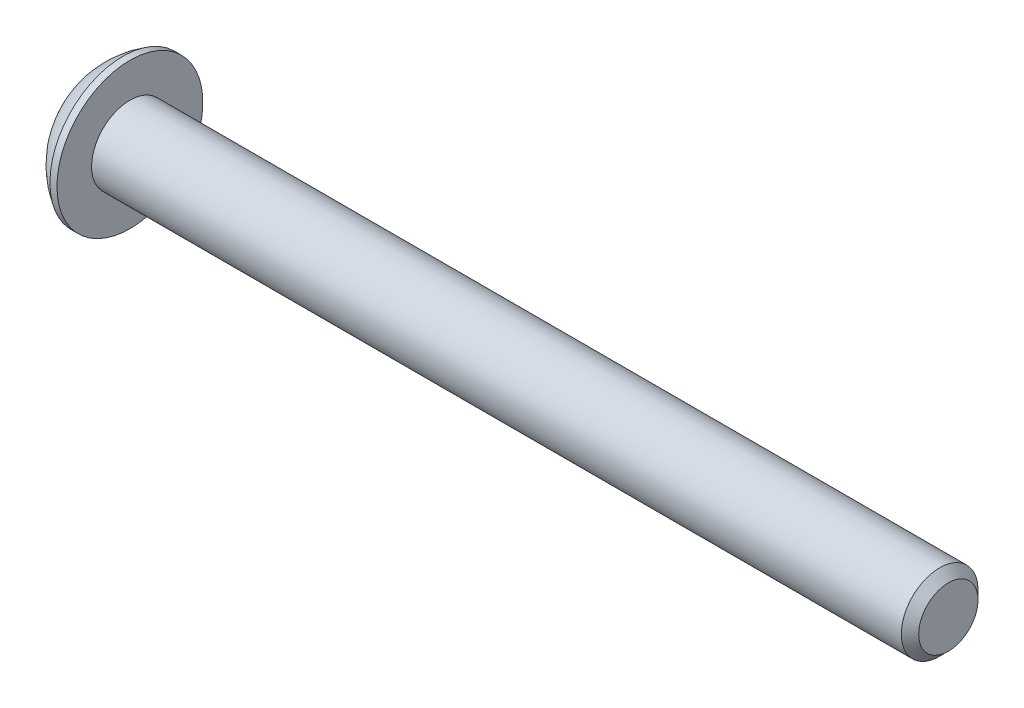
ISO-10303-21;
HEADER;
FILE_DESCRIPTION(('STEP AP214'),'2;1');
FILE_NAME('part.step','',(''),(''),'','','');
FILE_SCHEMA(('AUTOMOTIVE_DESIGN { 1 0 10303 214 1 1 1 1 }'));
ENDSEC;
DATA;
#1=APPLICATION_CONTEXT('core data for automotive mechanical design processes');
#2=APPLICATION_PROTOCOL_DEFINITION('international standard','automotive_design',2000,#1);
#3=PRODUCT_CONTEXT('',#1,'mechanical');
#4=PRODUCT('Part','Part','',(#3));
#5=PRODUCT_RELATED_PRODUCT_CATEGORY('part','',(#4));
#6=PRODUCT_DEFINITION_FORMATION('','',#4);
#7=PRODUCT_DEFINITION_CONTEXT('part definition',#1,'design');
#8=PRODUCT_DEFINITION('design','',#6,#7);
#9=PRODUCT_DEFINITION_SHAPE('','',#8);
#10=(LENGTH_UNIT() NAMED_UNIT(*) SI_UNIT(.MILLI.,.METRE.));
#11=(NAMED_UNIT(*) PLANE_ANGLE_UNIT() SI_UNIT($,.RADIAN.));
#12=(NAMED_UNIT(*) SI_UNIT($,.STERADIAN.) SOLID_ANGLE_UNIT());
#13=UNCERTAINTY_MEASURE_WITH_UNIT(LENGTH_MEASURE(1.E-05),#10,'distance_accuracy_value','');
#14=(GEOMETRIC_REPRESENTATION_CONTEXT(3) GLOBAL_UNCERTAINTY_ASSIGNED_CONTEXT((#13)) GLOBAL_UNIT_ASSIGNED_CONTEXT((#10,
#11,#12)) REPRESENTATION_CONTEXT('',''));
#15=CARTESIAN_POINT('',(0.,0.,0.));
#16=DIRECTION('',(0.,0.,1.));
#17=DIRECTION('',(1.,0.,0.));
#18=AXIS2_PLACEMENT_3D('',#15,#16,#17);
#19=CARTESIAN_POINT('',(1.32079999997359,0.,0.));
#20=DIRECTION('',(-1.,0.,0.));
#21=DIRECTION('',(0.,0.,1.));
#22=AXIS2_PLACEMENT_3D('',#19,#20,#21);
#23=CONICAL_SURFACE('',#22,1.19380000001001,1.04719755119008);
#24=CARTESIAN_POINT('',(2.0100407513155,0.,0.));
#25=VERTEX_POINT('',#24);
#26=VERTEX_LOOP('',#25);
#27=FACE_BOUND('',#26,.T.);
#28=CARTESIAN_POINT('',(1.32079999997359,0.,0.));
#29=DIRECTION('',(-1.,0.,0.));
#30=DIRECTION('',(0.,0.,1.));
#31=AXIS2_PLACEMENT_3D('',#28,#29,#30);
#32=CIRCLE('',#31,1.19380000001001);
#33=CARTESIAN_POINT('',(1.32079999998682,-1.0338611270422,0.596900000002503));
#34=VERTEX_POINT('',#33);
#35=CARTESIAN_POINT('',(1.32079999998682,0.,1.19380000000501));
#36=VERTEX_POINT('',#35);
#37=EDGE_CURVE('E91',#34,#36,#32,.T.);
#38=ORIENTED_EDGE('',*,*,#37,.T.);
#39=CARTESIAN_POINT('',(1.32079999997359,0.,0.));
#40=DIRECTION('',(-1.,0.,0.));
#41=DIRECTION('',(0.,0.,1.));
#42=AXIS2_PLACEMENT_3D('',#39,#40,#41);
#43=CIRCLE('',#42,1.19380000001001);
#44=CARTESIAN_POINT('',(1.32079999998682,1.0338611270422,0.596900000002504));
#45=VERTEX_POINT('',#44);
#46=EDGE_CURVE('E87',#36,#45,#43,.T.);
#47=ORIENTED_EDGE('',*,*,#46,.T.);
#48=CARTESIAN_POINT('',(1.32079999997359,0.,0.));
#49=DIRECTION('',(-1.,0.,0.));
#50=DIRECTION('',(0.,0.,1.));
#51=AXIS2_PLACEMENT_3D('',#48,#49,#50);
#52=CIRCLE('',#51,1.19380000001001);
#53=CARTESIAN_POINT('',(1.32079999998682,1.0338611270422,-0.596900000002504));
#54=VERTEX_POINT('',#53);
#55=EDGE_CURVE('E20',#45,#54,#52,.T.);
#56=ORIENTED_EDGE('',*,*,#55,.T.);
#57=CARTESIAN_POINT('',(1.32079999997359,0.,0.));
#58=DIRECTION('',(-1.,0.,0.));
#59=DIRECTION('',(0.,0.,1.));
#60=AXIS2_PLACEMENT_3D('',#57,#58,#59);
#61=CIRCLE('',#60,1.19380000001001);
#62=CARTESIAN_POINT('',(1.32079999998682,1.49461108489558E-12,-1.19380000000501));
#63=VERTEX_POINT('',#62);
#64=EDGE_CURVE('E150',#54,#63,#61,.T.);
#65=ORIENTED_EDGE('',*,*,#64,.T.);
#66=CARTESIAN_POINT('',(1.32079999997359,0.,0.));
#67=DIRECTION('',(-1.,0.,0.));
#68=DIRECTION('',(0.,0.,1.));
#69=AXIS2_PLACEMENT_3D('',#66,#67,#68);
#70=CIRCLE('',#69,1.19380000001001);
#71=CARTESIAN_POINT('',(1.32079999998682,-1.0338611270422,-0.596900000002503));
#72=VERTEX_POINT('',#71);
#73=EDGE_CURVE('E152',#63,#72,#70,.T.);
#74=ORIENTED_EDGE('',*,*,#73,.T.);
#75=CARTESIAN_POINT('',(1.32079999997359,0.,0.));
#76=DIRECTION('',(-1.,0.,0.));
#77=DIRECTION('',(0.,0.,1.));
#78=AXIS2_PLACEMENT_3D('',#75,#76,#77);
#79=CIRCLE('',#78,1.19380000001001);
#80=EDGE_CURVE('E154',#72,#34,#79,.T.);
#81=ORIENTED_EDGE('',*,*,#80,.T.);
#82=EDGE_LOOP('',(#38,#47,#56,#65,#74,#81));
#83=FACE_BOUND('',#82,.T.);
#84=ADVANCED_FACE('F16',(#27,#83),#23,.F.);
#85=CARTESIAN_POINT('',(1.3208,-2.06772225407572,-1.1938));
#86=DIRECTION('',(1.,0.,0.));
#87=DIRECTION('',(0.,0.,-1.));
#88=AXIS2_PLACEMENT_3D('',#85,#86,#87);
#89=PLANE('',#88);
#90=DIRECTION('',(0.,-0.5,-0.866025403784439));
#91=VECTOR('',#90,1.);
#92=CARTESIAN_POINT('',(1.32080000000004,1.37848150271715,0.));
#93=LINE('',#92,#91);
#94=CARTESIAN_POINT('',(1.32080000000001,1.37848150271715,0.));
#95=VERTEX_POINT('',#94);
#96=EDGE_CURVE('E103',#54,#95,#93,.F.);
#97=ORIENTED_EDGE('',*,*,#96,.F.);
#98=ORIENTED_EDGE('',*,*,#55,.F.);
#99=DIRECTION('',(0.,0.5,-0.866025403784439));
#100=VECTOR('',#99,1.);
#101=CARTESIAN_POINT('',(1.3208,0.689240751358576,1.1938));
#102=LINE('',#101,#100);
#103=EDGE_CURVE('E101',#95,#45,#102,.F.);
#104=ORIENTED_EDGE('',*,*,#103,.F.);
#105=EDGE_LOOP('',(#97,#98,#104));
#106=FACE_BOUND('',#105,.T.);
#107=ADVANCED_FACE('F99',(#106),#89,.F.);
#108=CARTESIAN_POINT('',(1.3208,-2.06772225407572,-1.1938));
#109=DIRECTION('',(1.,0.,0.));
#110=DIRECTION('',(0.,0.,-1.));
#111=AXIS2_PLACEMENT_3D('',#108,#109,#110);
#112=PLANE('',#111);
#113=DIRECTION('',(0.,0.5,-0.866025403784439));
#114=VECTOR('',#113,1.);
#115=CARTESIAN_POINT('',(1.32080000000004,0.689240751358576,1.1938));
#116=LINE('',#115,#114);
#117=CARTESIAN_POINT('',(1.32080000000001,0.689240751358576,1.1938));
#118=VERTEX_POINT('',#117);
#119=EDGE_CURVE('E105',#45,#118,#116,.F.);
#120=ORIENTED_EDGE('',*,*,#119,.F.);
#121=ORIENTED_EDGE('',*,*,#46,.F.);
#122=DIRECTION('',(0.,1.,0.));
#123=VECTOR('',#122,1.);
#124=CARTESIAN_POINT('',(1.3208,-0.689240751358574,1.1938));
#125=LINE('',#124,#123);
#126=EDGE_CURVE('E108',#118,#36,#125,.F.);
#127=ORIENTED_EDGE('',*,*,#126,.F.);
#128=EDGE_LOOP('',(#120,#121,#127));
#129=FACE_BOUND('',#128,.T.);
#130=ADVANCED_FACE('F106',(#129),#112,.F.);
#131=CARTESIAN_POINT('',(1.3208,-2.06772225407572,-1.1938));
#132=DIRECTION('',(1.,0.,0.));
#133=DIRECTION('',(0.,0.,-1.));
#134=AXIS2_PLACEMENT_3D('',#131,#132,#133);
#135=PLANE('',#134);
#136=DIRECTION('',(0.,1.,0.));
#137=VECTOR('',#136,1.);
#138=CARTESIAN_POINT('',(1.32080000000004,-0.689240751358574,1.1938));
#139=LINE('',#138,#137);
#140=CARTESIAN_POINT('',(1.32080000000001,-0.689240751358574,1.1938));
#141=VERTEX_POINT('',#140);
#142=EDGE_CURVE('E168',#36,#141,#139,.F.);
#143=ORIENTED_EDGE('',*,*,#142,.F.);
#144=ORIENTED_EDGE('',*,*,#37,.F.);
#145=DIRECTION('',(0.,0.5,0.866025403784439));
#146=VECTOR('',#145,1.);
#147=CARTESIAN_POINT('',(1.3208,-1.37848150271715,0.));
#148=LINE('',#147,#146);
#149=EDGE_CURVE('E166',#141,#34,#148,.F.);
#150=ORIENTED_EDGE('',*,*,#149,.F.);
#151=EDGE_LOOP('',(#143,#144,#150));
#152=FACE_BOUND('',#151,.T.);
#153=ADVANCED_FACE('F164',(#152),#135,.F.);
#154=CARTESIAN_POINT('',(1.3208,-2.06772225407572,-1.1938));
#155=DIRECTION('',(1.,0.,0.));
#156=DIRECTION('',(0.,0.,-1.));
#157=AXIS2_PLACEMENT_3D('',#154,#155,#156);
#158=PLANE('',#157);
#159=DIRECTION('',(0.,0.5,0.866025403784439));
#160=VECTOR('',#159,1.);
#161=CARTESIAN_POINT('',(1.32080000000004,-1.37848150271715,0.));
#162=LINE('',#161,#160);
#163=CARTESIAN_POINT('',(1.32080000000001,-1.37848150271715,0.));
#164=VERTEX_POINT('',#163);
#165=EDGE_CURVE('E169',#34,#164,#162,.F.);
#166=ORIENTED_EDGE('',*,*,#165,.F.);
#167=ORIENTED_EDGE('',*,*,#80,.F.);
#168=DIRECTION('',(0.,-0.5,0.866025403784439));
#169=VECTOR('',#168,1.);
#170=CARTESIAN_POINT('',(1.3208,-0.689240751358574,-1.1938));
#171=LINE('',#170,#169);
#172=EDGE_CURVE('E172',#164,#72,#171,.F.);
#173=ORIENTED_EDGE('',*,*,#172,.F.);
#174=EDGE_LOOP('',(#166,#167,#173));
#175=FACE_BOUND('',#174,.T.);
#176=ADVANCED_FACE('F170',(#175),#158,.F.);
#177=CARTESIAN_POINT('',(1.3208,-2.06772225407572,-1.1938));
#178=DIRECTION('',(1.,0.,0.));
#179=DIRECTION('',(0.,0.,-1.));
#180=AXIS2_PLACEMENT_3D('',#177,#178,#179);
#181=PLANE('',#180);
#182=DIRECTION('',(0.,-0.5,0.866025403784439));
#183=VECTOR('',#182,1.);
#184=CARTESIAN_POINT('',(1.32080000000004,-0.689240751358574,-1.1938));
#185=LINE('',#184,#183);
#186=CARTESIAN_POINT('',(1.32080000000001,-0.689240751358574,-1.1938));
#187=VERTEX_POINT('',#186);
#188=EDGE_CURVE('E227',#72,#187,#185,.F.);
#189=ORIENTED_EDGE('',*,*,#188,.F.);
#190=ORIENTED_EDGE('',*,*,#73,.F.);
#191=DIRECTION('',(0.,1.,0.));
#192=VECTOR('',#191,1.);
#193=CARTESIAN_POINT('',(1.3208,0.689240751358577,-1.1938));
#194=LINE('',#193,#192);
#195=EDGE_CURVE('E239',#187,#63,#194,.T.);
#196=ORIENTED_EDGE('',*,*,#195,.F.);
#197=EDGE_LOOP('',(#189,#190,#196));
#198=FACE_BOUND('',#197,.T.);
#199=ADVANCED_FACE('F389',(#198),#181,.F.);
#200=CARTESIAN_POINT('',(1.3208,-2.06772225407572,-1.1938));
#201=DIRECTION('',(1.,0.,0.));
#202=DIRECTION('',(0.,0.,-1.));
#203=AXIS2_PLACEMENT_3D('',#200,#201,#202);
#204=PLANE('',#203);
#205=DIRECTION('',(0.,1.,0.));
#206=VECTOR('',#205,1.);
#207=CARTESIAN_POINT('',(1.32080000000004,0.689240751358577,-1.1938));
#208=LINE('',#207,#206);
#209=CARTESIAN_POINT('',(1.32080000000002,0.689240751358565,-1.19380000000002));
#210=VERTEX_POINT('',#209);
#211=EDGE_CURVE('E247',#63,#210,#208,.T.);
#212=ORIENTED_EDGE('',*,*,#211,.F.);
#213=ORIENTED_EDGE('',*,*,#64,.F.);
#214=DIRECTION('',(0.,-0.5,-0.866025403784439));
#215=VECTOR('',#214,1.);
#216=CARTESIAN_POINT('',(1.3208,1.37848150271715,0.));
#217=LINE('',#216,#215);
#218=EDGE_CURVE('E127',#210,#54,#217,.F.);
#219=ORIENTED_EDGE('',*,*,#218,.F.);
#220=EDGE_LOOP('',(#212,#213,#219));
#221=FACE_BOUND('',#220,.T.);
#222=ADVANCED_FACE('F379',(#221),#204,.F.);
#223=CARTESIAN_POINT('',(1.3208,1.37848150271715,0.));
#224=DIRECTION('',(0.,-0.866025403784439,0.5));
#225=DIRECTION('',(0.,-0.5,-0.866025403784439));
#226=AXIS2_PLACEMENT_3D('',#223,#224,#225);
#227=PLANE('',#226);
#228=ORIENTED_EDGE('',*,*,#96,.T.);
#229=DIRECTION('',(1.,0.,0.));
#230=VECTOR('',#229,1.);
#231=CARTESIAN_POINT('',(1.3208,1.37848150271715,0.));
#232=LINE('',#231,#230);
#233=CARTESIAN_POINT('',(0.,1.37848150271715,0.));
#234=VERTEX_POINT('',#233);
#235=EDGE_CURVE('E115',#234,#95,#232,.T.);
#236=ORIENTED_EDGE('',*,*,#235,.F.);
#237=DIRECTION('',(0.,0.5,0.866025403784439));
#238=VECTOR('',#237,1.);
#239=CARTESIAN_POINT('',(0.,0.689240751358577,-1.1938));
#240=LINE('',#239,#238);
#241=CARTESIAN_POINT('',(0.,0.689240751358577,-1.1938));
#242=VERTEX_POINT('',#241);
#243=EDGE_CURVE('E130',#242,#234,#240,.T.);
#244=ORIENTED_EDGE('',*,*,#243,.F.);
#245=DIRECTION('',(1.,0.,0.));
#246=VECTOR('',#245,1.);
#247=CARTESIAN_POINT('',(1.3208,0.689240751358577,-1.1938));
#248=LINE('',#247,#246);
#249=EDGE_CURVE('E134',#210,#242,#248,.F.);
#250=ORIENTED_EDGE('',*,*,#249,.F.);
#251=ORIENTED_EDGE('',*,*,#218,.T.);
#252=EDGE_LOOP('',(#228,#236,#244,#250,#251));
#253=FACE_BOUND('',#252,.T.);
#254=ADVANCED_FACE('F370',(#253),#227,.T.);
#255=CARTESIAN_POINT('',(1.3208,0.689240751358576,1.1938));
#256=DIRECTION('',(0.,-0.866025403784439,-0.5));
#257=DIRECTION('',(0.,0.5,-0.866025403784439));
#258=AXIS2_PLACEMENT_3D('',#255,#256,#257);
#259=PLANE('',#258);
#260=ORIENTED_EDGE('',*,*,#119,.T.);
#261=DIRECTION('',(1.,0.,0.));
#262=VECTOR('',#261,1.);
#263=CARTESIAN_POINT('',(1.3208,0.689240751358576,1.1938));
#264=LINE('',#263,#262);
#265=CARTESIAN_POINT('',(0.,0.689240751358577,1.1938));
#266=VERTEX_POINT('',#265);
#267=EDGE_CURVE('E111',#266,#118,#264,.T.);
#268=ORIENTED_EDGE('',*,*,#267,.F.);
#269=DIRECTION('',(0.,-0.5,0.866025403784439));
#270=VECTOR('',#269,1.);
#271=CARTESIAN_POINT('',(0.,1.37848150271715,0.));
#272=LINE('',#271,#270);
#273=EDGE_CURVE('E133',#234,#266,#272,.T.);
#274=ORIENTED_EDGE('',*,*,#273,.F.);
#275=ORIENTED_EDGE('',*,*,#235,.T.);
#276=ORIENTED_EDGE('',*,*,#103,.T.);
#277=EDGE_LOOP('',(#260,#268,#274,#275,#276));
#278=FACE_BOUND('',#277,.T.);
#279=ADVANCED_FACE('F113',(#278),#259,.T.);
#280=CARTESIAN_POINT('',(1.3208,-0.689240751358574,1.1938));
#281=DIRECTION('',(0.,0.,-1.));
#282=DIRECTION('',(0.,1.,0.));
#283=AXIS2_PLACEMENT_3D('',#280,#281,#282);
#284=PLANE('',#283);
#285=ORIENTED_EDGE('',*,*,#142,.T.);
#286=DIRECTION('',(1.,0.,0.));
#287=VECTOR('',#286,1.);
#288=CARTESIAN_POINT('',(1.3208,-0.689240751358574,1.1938));
#289=LINE('',#288,#287);
#290=CARTESIAN_POINT('',(0.,-0.689240751358574,1.1938));
#291=VERTEX_POINT('',#290);
#292=EDGE_CURVE('E179',#291,#141,#289,.T.);
#293=ORIENTED_EDGE('',*,*,#292,.F.);
#294=DIRECTION('',(0.,1.,0.));
#295=VECTOR('',#294,1.);
#296=CARTESIAN_POINT('',(0.,0.,1.1938));
#297=LINE('',#296,#295);
#298=EDGE_CURVE('E193',#266,#291,#297,.F.);
#299=ORIENTED_EDGE('',*,*,#298,.F.);
#300=ORIENTED_EDGE('',*,*,#267,.T.);
#301=ORIENTED_EDGE('',*,*,#126,.T.);
#302=EDGE_LOOP('',(#285,#293,#299,#300,#301));
#303=FACE_BOUND('',#302,.T.);
#304=ADVANCED_FACE('F215',(#303),#284,.T.);
#305=CARTESIAN_POINT('',(1.3208,-1.37848150271715,0.));
#306=DIRECTION('',(0.,0.866025403784439,-0.5));
#307=DIRECTION('',(0.,0.5,0.866025403784439));
#308=AXIS2_PLACEMENT_3D('',#305,#306,#307);
#309=PLANE('',#308);
#310=ORIENTED_EDGE('',*,*,#165,.T.);
#311=DIRECTION('',(1.,0.,0.));
#312=VECTOR('',#311,1.);
#313=CARTESIAN_POINT('',(1.3208,-1.37848150271715,0.));
#314=LINE('',#313,#312);
#315=CARTESIAN_POINT('',(0.,-1.37848150271715,0.));
#316=VERTEX_POINT('',#315);
#317=EDGE_CURVE('E175',#316,#164,#314,.T.);
#318=ORIENTED_EDGE('',*,*,#317,.F.);
#319=DIRECTION('',(0.,-0.5,-0.866025403784439));
#320=VECTOR('',#319,1.);
#321=CARTESIAN_POINT('',(0.,-0.689240751358574,1.1938));
#322=LINE('',#321,#320);
#323=EDGE_CURVE('E196',#291,#316,#322,.T.);
#324=ORIENTED_EDGE('',*,*,#323,.F.);
#325=ORIENTED_EDGE('',*,*,#292,.T.);
#326=ORIENTED_EDGE('',*,*,#149,.T.);
#327=EDGE_LOOP('',(#310,#318,#324,#325,#326));
#328=FACE_BOUND('',#327,.T.);
#329=ADVANCED_FACE('F177',(#328),#309,.T.);
#330=CARTESIAN_POINT('',(1.3208,-0.689240751358574,-1.1938));
#331=DIRECTION('',(0.,0.866025403784439,0.5));
#332=DIRECTION('',(0.,-0.5,0.866025403784439));
#333=AXIS2_PLACEMENT_3D('',#330,#331,#332);
#334=PLANE('',#333);
#335=ORIENTED_EDGE('',*,*,#188,.T.);
#336=DIRECTION('',(1.,0.,0.));
#337=VECTOR('',#336,1.);
#338=CARTESIAN_POINT('',(1.3208,-0.689240751358574,-1.1938));
#339=LINE('',#338,#337);
#340=CARTESIAN_POINT('',(0.,-0.689240751358574,-1.1938));
#341=VERTEX_POINT('',#340);
#342=EDGE_CURVE('E35',#341,#187,#339,.T.);
#343=ORIENTED_EDGE('',*,*,#342,.F.);
#344=DIRECTION('',(0.,0.5,-0.866025403784439));
#345=VECTOR('',#344,1.);
#346=CARTESIAN_POINT('',(0.,-1.37848150271715,0.));
#347=LINE('',#346,#345);
#348=EDGE_CURVE('E216',#316,#341,#347,.T.);
#349=ORIENTED_EDGE('',*,*,#348,.F.);
#350=ORIENTED_EDGE('',*,*,#317,.T.);
#351=ORIENTED_EDGE('',*,*,#172,.T.);
#352=EDGE_LOOP('',(#335,#343,#349,#350,#351));
#353=FACE_BOUND('',#352,.T.);
#354=ADVANCED_FACE('F336',(#353),#334,.T.);
#355=CARTESIAN_POINT('',(1.3208,0.689240751358577,-1.1938));
#356=DIRECTION('',(0.,0.,1.));
#357=DIRECTION('',(1.,0.,0.));
#358=AXIS2_PLACEMENT_3D('',#355,#356,#357);
#359=PLANE('',#358);
#360=ORIENTED_EDGE('',*,*,#211,.T.);
#361=ORIENTED_EDGE('',*,*,#249,.T.);
#362=DIRECTION('',(0.,1.,0.));
#363=VECTOR('',#362,1.);
#364=CARTESIAN_POINT('',(0.,0.,-1.1938));
#365=LINE('',#364,#363);
#366=EDGE_CURVE('E149',#341,#242,#365,.T.);
#367=ORIENTED_EDGE('',*,*,#366,.F.);
#368=ORIENTED_EDGE('',*,*,#342,.T.);
#369=ORIENTED_EDGE('',*,*,#195,.T.);
#370=EDGE_LOOP('',(#360,#361,#367,#368,#369));
#371=FACE_BOUND('',#370,.T.);
#372=ADVANCED_FACE('F327',(#371),#359,.T.);
#373=CARTESIAN_POINT('',(0.,0.,0.));
#374=DIRECTION('',(-1.,0.,0.));
#375=DIRECTION('',(0.,0.,1.));
#376=AXIS2_PLACEMENT_3D('',#373,#374,#375);
#377=PLANE('',#376);
#378=CARTESIAN_POINT('',(0.,0.,0.));
#379=DIRECTION('',(-1.,0.,0.));
#380=DIRECTION('',(0.,0.,1.));
#381=AXIS2_PLACEMENT_3D('',#378,#379,#380);
#382=CIRCLE('',#381,1.9812);
#383=CARTESIAN_POINT('',(0.,0.,1.9812));
#384=VERTEX_POINT('',#383);
#385=EDGE_CURVE('E146',#384,#384,#382,.F.);
#386=ORIENTED_EDGE('',*,*,#385,.F.);
#387=EDGE_LOOP('',(#386));
#388=FACE_BOUND('',#387,.T.);
#389=ORIENTED_EDGE('',*,*,#348,.T.);
#390=ORIENTED_EDGE('',*,*,#366,.T.);
#391=ORIENTED_EDGE('',*,*,#243,.T.);
#392=ORIENTED_EDGE('',*,*,#273,.T.);
#393=ORIENTED_EDGE('',*,*,#298,.T.);
#394=ORIENTED_EDGE('',*,*,#323,.T.);
#395=EDGE_LOOP('',(#389,#390,#391,#392,#393,#394));
#396=FACE_BOUND('',#395,.T.);
#397=ADVANCED_FACE('F209',(#388,#396),#377,.T.);
#398=CARTESIAN_POINT('',(4.13385,0.,0.));
#399=DIRECTION('',(0.,1.,0.));
#400=DIRECTION('',(-0.489667403954941,0.,-0.871909303485189));
#401=AXIS2_PLACEMENT_3D('',#398,#399,#400);
#402=SPHERICAL_SURFACE('',#401,4.58408870578439);
#403=CARTESIAN_POINT('',(4.13385,0.,0.));
#404=DIRECTION('',(-1.,0.,0.));
#405=DIRECTION('',(0.,0.,1.));
#406=AXIS2_PLACEMENT_3D('',#403,#404,#405);
#407=SPHERICAL_SURFACE('',#406,4.58408870578439);
#408=ORIENTED_EDGE('',*,*,#385,.T.);
#409=EDGE_LOOP('',(#408));
#410=FACE_BOUND('',#409,.T.);
#411=CARTESIAN_POINT('',(1.8288,0.,0.));
#412=DIRECTION('',(-1.,0.,0.));
#413=DIRECTION('',(0.,0.,1.));
#414=AXIS2_PLACEMENT_3D('',#411,#412,#413);
#415=CIRCLE('',#414,3.9624);
#416=CARTESIAN_POINT('',(1.8288,0.,3.9624));
#417=VERTEX_POINT('',#416);
#418=EDGE_CURVE('E143',#417,#417,#415,.F.);
#419=ORIENTED_EDGE('',*,*,#418,.F.);
#420=EDGE_LOOP('',(#419));
#421=FACE_BOUND('',#420,.T.);
#422=ADVANCED_FACE('F18',(#410,#421),#407,.T.);
#423=CARTESIAN_POINT('',(46.6598,0.,0.));
#424=DIRECTION('',(-1.,0.,0.));
#425=DIRECTION('',(0.,0.,1.));
#426=AXIS2_PLACEMENT_3D('',#423,#424,#425);
#427=PLANE('',#426);
#428=CARTESIAN_POINT('',(46.6598000000431,0.,0.));
#429=DIRECTION('',(-1.,0.,0.));
#430=DIRECTION('',(0.,0.,1.));
#431=AXIS2_PLACEMENT_3D('',#428,#429,#430);
#432=CIRCLE('',#431,1.61035999997239);
#433=CARTESIAN_POINT('',(46.6598000000431,0.,1.61035999997239));
#434=VERTEX_POINT('',#433);
#435=EDGE_CURVE('E140',#434,#434,#432,.T.);
#436=ORIENTED_EDGE('',*,*,#435,.F.);
#437=EDGE_LOOP('',(#436));
#438=FACE_BOUND('',#437,.T.);
#439=ADVANCED_FACE('F269',(#438),#427,.F.);
#440=CARTESIAN_POINT('',(0.,0.,0.));
#441=DIRECTION('',(-1.,0.,0.));
#442=DIRECTION('',(0.,0.,1.));
#443=AXIS2_PLACEMENT_3D('',#440,#441,#442);
#444=CYLINDRICAL_SURFACE('',#443,3.9624);
#445=ORIENTED_EDGE('',*,*,#418,.T.);
#446=EDGE_LOOP('',(#445));
#447=FACE_BOUND('',#446,.T.);
#448=CARTESIAN_POINT('',(2.2098,0.,0.));
#449=DIRECTION('',(-1.,0.,0.));
#450=DIRECTION('',(0.,0.,1.));
#451=AXIS2_PLACEMENT_3D('',#448,#449,#450);
#452=CIRCLE('',#451,3.9624);
#453=CARTESIAN_POINT('',(2.2098,0.,3.9624));
#454=VERTEX_POINT('',#453);
#455=EDGE_CURVE('E137',#454,#454,#452,.T.);
#456=ORIENTED_EDGE('',*,*,#455,.T.);
#457=EDGE_LOOP('',(#456));
#458=FACE_BOUND('',#457,.T.);
#459=ADVANCED_FACE('F265',(#447,#458),#444,.T.);
#460=CARTESIAN_POINT('',(46.1873600000331,0.,0.));
#461=DIRECTION('',(-1.,0.,0.));
#462=DIRECTION('',(0.,0.,1.));
#463=AXIS2_PLACEMENT_3D('',#460,#461,#462);
#464=CONICAL_SURFACE('',#463,2.0827999999824,0.785398163397448);
#465=CARTESIAN_POINT('',(46.18736,0.,0.));
#466=DIRECTION('',(-1.,0.,0.));
#467=DIRECTION('',(0.,0.,1.));
#468=AXIS2_PLACEMENT_3D('',#465,#466,#467);
#469=CIRCLE('',#468,2.0828);
#470=CARTESIAN_POINT('',(46.18736,0.,2.0828));
#471=VERTEX_POINT('',#470);
#472=EDGE_CURVE('E26',#471,#471,#469,.T.);
#473=ORIENTED_EDGE('',*,*,#472,.F.);
#474=EDGE_LOOP('',(#473));
#475=FACE_BOUND('',#474,.T.);
#476=ORIENTED_EDGE('',*,*,#435,.T.);
#477=EDGE_LOOP('',(#476));
#478=FACE_BOUND('',#477,.T.);
#479=ADVANCED_FACE('F261',(#475,#478),#464,.T.);
#480=CARTESIAN_POINT('',(2.2098,2.0828,0.));
#481=DIRECTION('',(-1.,0.,0.));
#482=DIRECTION('',(0.,0.,1.));
#483=AXIS2_PLACEMENT_3D('',#480,#481,#482);
#484=PLANE('',#483);
#485=ORIENTED_EDGE('',*,*,#455,.F.);
#486=EDGE_LOOP('',(#485));
#487=FACE_BOUND('',#486,.T.);
#488=CARTESIAN_POINT('',(2.2098,0.,0.));
#489=DIRECTION('',(-1.,0.,0.));
#490=DIRECTION('',(0.,0.,1.));
#491=AXIS2_PLACEMENT_3D('',#488,#489,#490);
#492=CIRCLE('',#491,2.0828);
#493=CARTESIAN_POINT('',(2.2098,0.,2.0828));
#494=VERTEX_POINT('',#493);
#495=EDGE_CURVE('E11',#494,#494,#492,.F.);
#496=ORIENTED_EDGE('',*,*,#495,.F.);
#497=EDGE_LOOP('',(#496));
#498=FACE_BOUND('',#497,.T.);
#499=ADVANCED_FACE('F264',(#487,#498),#484,.F.);
#500=CARTESIAN_POINT('',(0.,0.,0.));
#501=DIRECTION('',(-1.,0.,0.));
#502=DIRECTION('',(0.,0.,1.));
#503=AXIS2_PLACEMENT_3D('',#500,#501,#502);
#504=CYLINDRICAL_SURFACE('',#503,2.0828);
#505=ORIENTED_EDGE('',*,*,#495,.T.);
#506=EDGE_LOOP('',(#505));
#507=FACE_BOUND('',#506,.T.);
#508=ORIENTED_EDGE('',*,*,#472,.T.);
#509=EDGE_LOOP('',(#508));
#510=FACE_BOUND('',#509,.T.);
#511=ADVANCED_FACE('F259',(#507,#510),#504,.T.);
#512=CLOSED_SHELL('',(#84,#107,#130,#153,#176,#199,#222,#254,#279,#304,#329,#354,#372,#397,#422,
#439,#459,#479,#499,#511));
#513=MANIFOLD_SOLID_BREP('B1',#512);
#514=ADVANCED_BREP_SHAPE_REPRESENTATION('',(#18,#513),#14);
#515=SHAPE_DEFINITION_REPRESENTATION(#9,#514);
ENDSEC;
END-ISO-10303-21;
